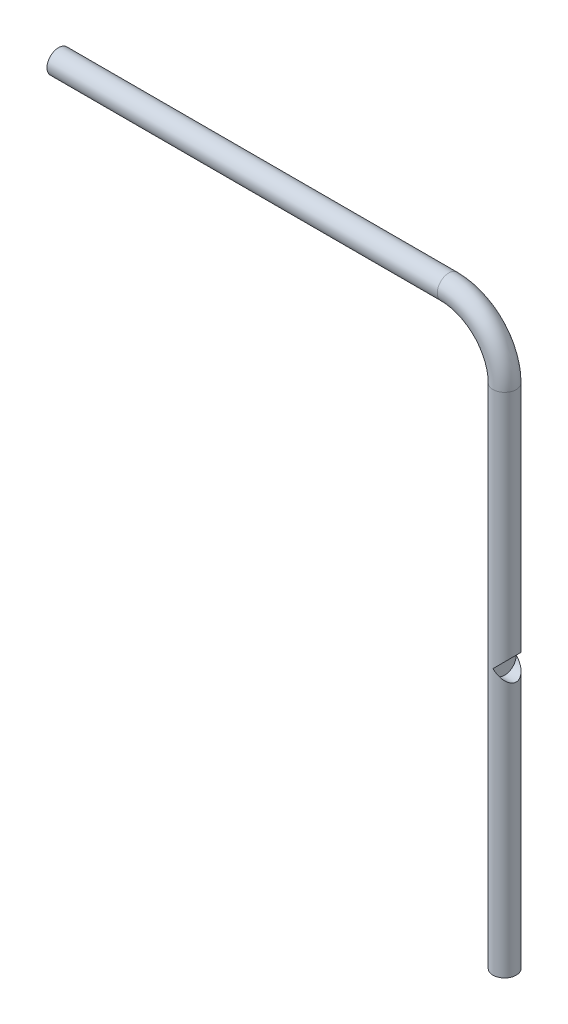
ISO-10303-21;
HEADER;
FILE_DESCRIPTION(('STEP AP214'),'2;1');
FILE_NAME('part.step','',(''),(''),'','','');
FILE_SCHEMA(('AUTOMOTIVE_DESIGN { 1 0 10303 214 1 1 1 1 }'));
ENDSEC;
DATA;
#1=APPLICATION_CONTEXT('core data for automotive mechanical design processes');
#2=APPLICATION_PROTOCOL_DEFINITION('international standard','automotive_design',2000,#1);
#3=PRODUCT_CONTEXT('',#1,'mechanical');
#4=PRODUCT('Part','Part','',(#3));
#5=PRODUCT_RELATED_PRODUCT_CATEGORY('part','',(#4));
#6=PRODUCT_DEFINITION_FORMATION('','',#4);
#7=PRODUCT_DEFINITION_CONTEXT('part definition',#1,'design');
#8=PRODUCT_DEFINITION('design','',#6,#7);
#9=PRODUCT_DEFINITION_SHAPE('','',#8);
#10=(LENGTH_UNIT() NAMED_UNIT(*) SI_UNIT(.MILLI.,.METRE.));
#11=(NAMED_UNIT(*) PLANE_ANGLE_UNIT() SI_UNIT($,.RADIAN.));
#12=(NAMED_UNIT(*) SI_UNIT($,.STERADIAN.) SOLID_ANGLE_UNIT());
#13=UNCERTAINTY_MEASURE_WITH_UNIT(LENGTH_MEASURE(1.E-05),#10,'distance_accuracy_value','');
#14=(GEOMETRIC_REPRESENTATION_CONTEXT(3) GLOBAL_UNCERTAINTY_ASSIGNED_CONTEXT((#13)) GLOBAL_UNIT_ASSIGNED_CONTEXT((#10,
#11,#12)) REPRESENTATION_CONTEXT('',''));
#15=CARTESIAN_POINT('',(0.,0.,0.));
#16=DIRECTION('',(0.,0.,1.));
#17=DIRECTION('',(1.,0.,0.));
#18=AXIS2_PLACEMENT_3D('',#15,#16,#17);
#19=CARTESIAN_POINT('',(0.,0.,0.));
#20=DIRECTION('',(0.,1.,0.));
#21=DIRECTION('',(0.,0.,1.));
#22=AXIS2_PLACEMENT_3D('',#19,#20,#21);
#23=CYLINDRICAL_SURFACE('',#22,12.5);
#24=CARTESIAN_POINT('',(0.,-50.79,0.));
#25=DIRECTION('',(0.,-1.,0.));
#26=DIRECTION('',(0.,0.,-1.));
#27=AXIS2_PLACEMENT_3D('',#24,#25,#26);
#28=CIRCLE('',#27,12.5);
#29=CARTESIAN_POINT('',(0.,-50.79,-12.5));
#30=VERTEX_POINT('',#29);
#31=EDGE_CURVE('E82',#30,#30,#28,.T.);
#32=ORIENTED_EDGE('',*,*,#31,.F.);
#33=EDGE_LOOP('',(#32));
#34=FACE_BOUND('',#33,.T.);
#35=CARTESIAN_POINT('',(0.,495.,0.));
#36=DIRECTION('',(0.,-1.,0.));
#37=DIRECTION('',(0.,0.,-1.));
#38=AXIS2_PLACEMENT_3D('',#35,#36,#37);
#39=CIRCLE('',#38,12.5);
#40=CARTESIAN_POINT('',(12.5,495.,0.));
#41=VERTEX_POINT('',#40);
#42=EDGE_CURVE('E114',#41,#41,#39,.T.);
#43=ORIENTED_EDGE('',*,*,#42,.T.);
#44=EDGE_LOOP('',(#43));
#45=FACE_BOUND('',#44,.T.);
#46=CARTESIAN_POINT('',(0.,235.,0.));
#47=DIRECTION('',(-0.707106781186547,0.707106781186548,0.));
#48=DIRECTION('',(0.707106781186547,0.707106781186548,0.));
#49=AXIS2_PLACEMENT_3D('',#46,#47,#48);
#50=ELLIPSE('',#49,17.6776695296637,12.5);
#51=CARTESIAN_POINT('',(0.,235.,-12.5));
#52=VERTEX_POINT('',#51);
#53=CARTESIAN_POINT('',(0.,235.,12.5));
#54=VERTEX_POINT('',#53);
#55=EDGE_CURVE('E12',#52,#54,#50,.F.);
#56=ORIENTED_EDGE('',*,*,#55,.F.);
#57=CARTESIAN_POINT('',(0.,235.,0.));
#58=DIRECTION('',(0.707106781186547,0.707106781186548,0.));
#59=DIRECTION('',(-0.707106781186547,0.707106781186548,0.));
#60=AXIS2_PLACEMENT_3D('',#57,#58,#59);
#61=ELLIPSE('',#60,17.6776695296637,12.5);
#62=EDGE_CURVE('E59',#54,#52,#61,.T.);
#63=ORIENTED_EDGE('',*,*,#62,.F.);
#64=EDGE_LOOP('',(#56,#63));
#65=FACE_BOUND('',#64,.T.);
#66=ADVANCED_FACE('F50',(#34,#45,#65),#23,.T.);
#67=CARTESIAN_POINT('',(-480.,555.,0.));
#68=DIRECTION('',(1.,0.,0.));
#69=DIRECTION('',(0.,0.,-1.));
#70=AXIS2_PLACEMENT_3D('',#67,#68,#69);
#71=PLANE('',#70);
#72=CARTESIAN_POINT('',(-480.,555.,0.));
#73=DIRECTION('',(1.,0.,0.));
#74=DIRECTION('',(0.,0.,-1.));
#75=AXIS2_PLACEMENT_3D('',#72,#73,#74);
#76=CIRCLE('',#75,12.5);
#77=CARTESIAN_POINT('',(-480.,555.,-12.5));
#78=VERTEX_POINT('',#77);
#79=EDGE_CURVE('E75',#78,#78,#76,.T.);
#80=ORIENTED_EDGE('',*,*,#79,.F.);
#81=EDGE_LOOP('',(#80));
#82=FACE_BOUND('',#81,.T.);
#83=ADVANCED_FACE('F52',(#82),#71,.F.);
#84=CARTESIAN_POINT('',(-60.,495.,0.));
#85=DIRECTION('',(0.,0.,1.));
#86=DIRECTION('',(1.,0.,0.));
#87=AXIS2_PLACEMENT_3D('',#84,#85,#86);
#88=TOROIDAL_SURFACE('',#87,60.,12.5);
#89=CARTESIAN_POINT('',(-59.9999999999996,555.,0.));
#90=DIRECTION('',(1.,0.,0.));
#91=DIRECTION('',(0.,0.,-1.));
#92=AXIS2_PLACEMENT_3D('',#89,#90,#91);
#93=CIRCLE('',#92,12.5);
#94=CARTESIAN_POINT('',(-59.9999999999995,567.5,0.));
#95=VERTEX_POINT('',#94);
#96=EDGE_CURVE('E112',#95,#95,#93,.T.);
#97=CARTESIAN_POINT('',(-60.,495.,0.));
#98=DIRECTION('',(0.,0.,1.));
#99=DIRECTION('',(1.,0.,0.));
#100=AXIS2_PLACEMENT_3D('',#97,#98,#99);
#101=CIRCLE('',#100,72.5);
#102=EDGE_CURVE('',#41,#95,#101,.T.);
#103=ORIENTED_EDGE('',*,*,#42,.F.);
#104=ORIENTED_EDGE('',*,*,#96,.T.);
#105=ORIENTED_EDGE('',*,*,#102,.T.);
#106=ORIENTED_EDGE('',*,*,#102,.F.);
#107=EDGE_LOOP('',(#103,#105,#104,#106));
#108=FACE_BOUND('',#107,.T.);
#109=ADVANCED_FACE('F92',(#108),#88,.T.);
#110=CARTESIAN_POINT('',(-60.0000000000001,555.,0.));
#111=DIRECTION('',(-1.,0.,0.));
#112=DIRECTION('',(0.,0.,1.));
#113=AXIS2_PLACEMENT_3D('',#110,#111,#112);
#114=CYLINDRICAL_SURFACE('',#113,12.5);
#115=ORIENTED_EDGE('',*,*,#79,.T.);
#116=EDGE_LOOP('',(#115));
#117=FACE_BOUND('',#116,.T.);
#118=ORIENTED_EDGE('',*,*,#96,.F.);
#119=EDGE_LOOP('',(#118));
#120=FACE_BOUND('',#119,.T.);
#121=ADVANCED_FACE('F86',(#117,#120),#114,.T.);
#122=CARTESIAN_POINT('',(0.,-50.79,0.));
#123=DIRECTION('',(0.,-1.,0.));
#124=DIRECTION('',(0.,0.,-1.));
#125=AXIS2_PLACEMENT_3D('',#122,#123,#124);
#126=PLANE('',#125);
#127=ORIENTED_EDGE('',*,*,#31,.T.);
#128=EDGE_LOOP('',(#127));
#129=FACE_BOUND('',#128,.T.);
#130=ADVANCED_FACE('F94',(#129),#126,.T.);
#131=CARTESIAN_POINT('',(50.79,235.,0.));
#132=DIRECTION('',(-1.,0.,0.));
#133=DIRECTION('',(0.,0.,1.));
#134=AXIS2_PLACEMENT_3D('',#131,#132,#133);
#135=CYLINDRICAL_SURFACE('',#134,12.5);
#136=ORIENTED_EDGE('',*,*,#55,.T.);
#137=CARTESIAN_POINT('',(0.,235.,0.));
#138=DIRECTION('',(1.,0.,0.));
#139=DIRECTION('',(0.,0.,-1.));
#140=AXIS2_PLACEMENT_3D('',#137,#138,#139);
#141=CIRCLE('',#140,12.5);
#142=EDGE_CURVE('E65',#52,#54,#141,.T.);
#143=ORIENTED_EDGE('',*,*,#142,.F.);
#144=EDGE_LOOP('',(#136,#143));
#145=FACE_BOUND('',#144,.T.);
#146=ADVANCED_FACE('F80',(#145),#135,.F.);
#147=ORIENTED_EDGE('',*,*,#62,.T.);
#148=EDGE_CURVE('E71',#54,#52,#141,.T.);
#149=ORIENTED_EDGE('',*,*,#148,.F.);
#150=EDGE_LOOP('',(#147,#149));
#151=FACE_BOUND('',#150,.T.);
#152=ADVANCED_FACE('F70',(#151),#135,.F.);
#153=CARTESIAN_POINT('',(0.,235.,0.));
#154=DIRECTION('',(1.,0.,0.));
#155=DIRECTION('',(0.,0.,-1.));
#156=AXIS2_PLACEMENT_3D('',#153,#154,#155);
#157=PLANE('',#156);
#158=ORIENTED_EDGE('',*,*,#142,.T.);
#159=ORIENTED_EDGE('',*,*,#148,.T.);
#160=EDGE_LOOP('',(#158,#159));
#161=FACE_BOUND('',#160,.T.);
#162=ADVANCED_FACE('F76',(#161),#157,.T.);
#163=CLOSED_SHELL('',(#66,#83,#109,#121,#130,#146,#152,#162));
#164=MANIFOLD_SOLID_BREP('B2',#163);
#165=ADVANCED_BREP_SHAPE_REPRESENTATION('',(#18,#164),#14);
#166=SHAPE_DEFINITION_REPRESENTATION(#9,#165);
ENDSEC;
END-ISO-10303-21;
